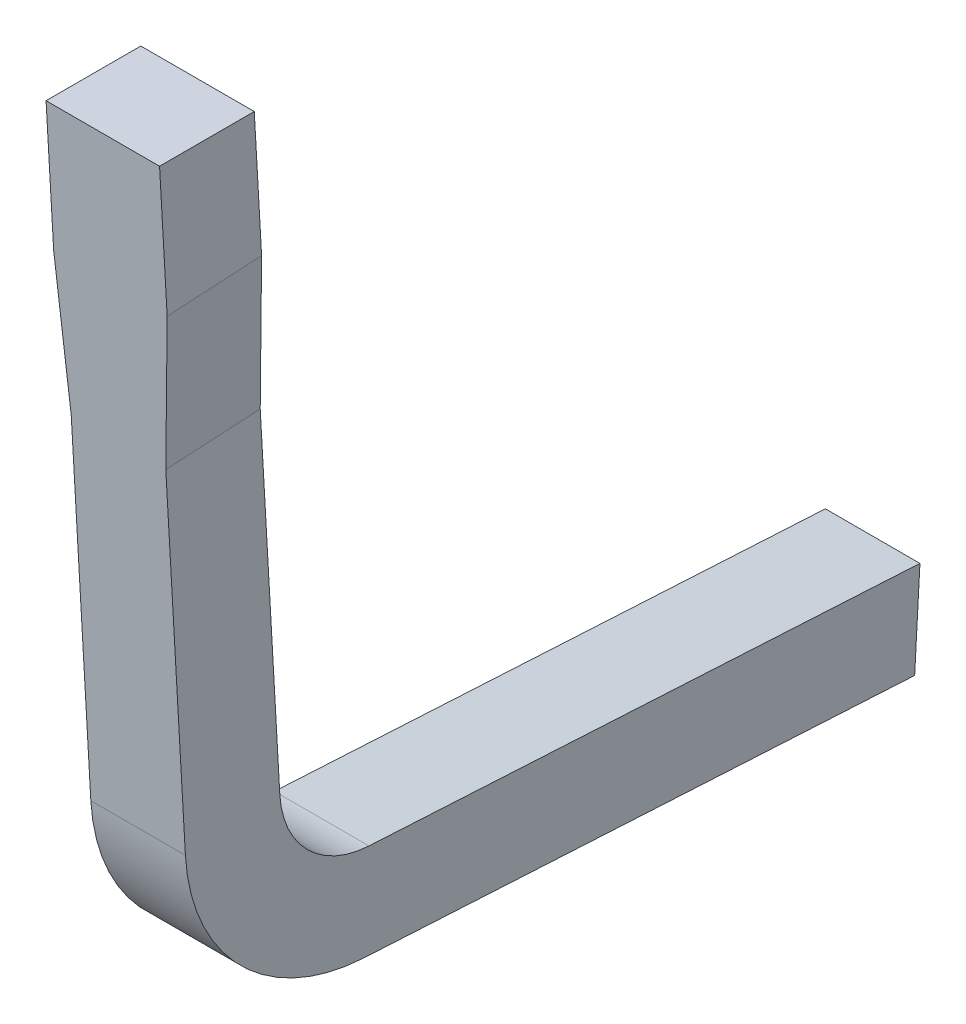
ISO-10303-21;
HEADER;
FILE_DESCRIPTION(('STEP AP214'),'2;1');
FILE_NAME('part.step','',(''),(''),'','','');
FILE_SCHEMA(('AUTOMOTIVE_DESIGN { 1 0 10303 214 1 1 1 1 }'));
ENDSEC;
DATA;
#1=APPLICATION_CONTEXT('core data for automotive mechanical design processes');
#2=APPLICATION_PROTOCOL_DEFINITION('international standard','automotive_design',2000,#1);
#3=PRODUCT_CONTEXT('',#1,'mechanical');
#4=PRODUCT('Part','Part','',(#3));
#5=PRODUCT_RELATED_PRODUCT_CATEGORY('part','',(#4));
#6=PRODUCT_DEFINITION_FORMATION('','',#4);
#7=PRODUCT_DEFINITION_CONTEXT('part definition',#1,'design');
#8=PRODUCT_DEFINITION('design','',#6,#7);
#9=PRODUCT_DEFINITION_SHAPE('','',#8);
#10=(LENGTH_UNIT() NAMED_UNIT(*) SI_UNIT(.MILLI.,.METRE.));
#11=(NAMED_UNIT(*) PLANE_ANGLE_UNIT() SI_UNIT($,.RADIAN.));
#12=(NAMED_UNIT(*) SI_UNIT($,.STERADIAN.) SOLID_ANGLE_UNIT());
#13=UNCERTAINTY_MEASURE_WITH_UNIT(LENGTH_MEASURE(1.E-05),#10,'distance_accuracy_value','');
#14=(GEOMETRIC_REPRESENTATION_CONTEXT(3) GLOBAL_UNCERTAINTY_ASSIGNED_CONTEXT((#13)) GLOBAL_UNIT_ASSIGNED_CONTEXT((#10,
#11,#12)) REPRESENTATION_CONTEXT('',''));
#15=CARTESIAN_POINT('',(0.,0.,0.));
#16=DIRECTION('',(0.,0.,1.));
#17=DIRECTION('',(1.,0.,0.));
#18=AXIS2_PLACEMENT_3D('',#15,#16,#17);
#19=CARTESIAN_POINT('',(-1.12,-1.879082198882,-10.32387202233));
#20=DIRECTION('',(1.,0.,0.));
#21=DIRECTION('',(0.,0.,-1.));
#22=AXIS2_PLACEMENT_3D('',#19,#20,#21);
#23=PLANE('',#22);
#24=DIRECTION('',(1.7997756063594E-13,-0.0569406083160486,0.998377567418559));
#25=VECTOR('',#24,1.);
#26=CARTESIAN_POINT('',(-1.12,-2.014836222708,-10.43177700759));
#27=LINE('',#26,#25);
#28=CARTESIAN_POINT('',(-1.12,-2.01483622270796,-10.4317770075908));
#29=VERTEX_POINT('',#28);
#30=CARTESIAN_POINT('',(-1.11999999999999,-2.02622434437119,-10.2321014941066));
#31=VERTEX_POINT('',#30);
#32=EDGE_CURVE('E183',#29,#31,#27,.T.);
#33=ORIENTED_EDGE('',*,*,#32,.T.);
#34=DIRECTION('',(0.,-0.998377567418999,-0.0569406083083299));
#35=VECTOR('',#34,1.);
#36=CARTESIAN_POINT('',(-1.12,-2.398052209196,-10.25330800505));
#37=LINE('',#36,#35);
#38=CARTESIAN_POINT('',(-1.12,-1.74332817505504,-10.2159670370689));
#39=VERTEX_POINT('',#38);
#40=EDGE_CURVE('E180',#39,#31,#37,.T.);
#41=ORIENTED_EDGE('',*,*,#40,.F.);
#42=DIRECTION('',(0.,0.,1.));
#43=VECTOR('',#42,1.);
#44=CARTESIAN_POINT('',(-1.12,-1.743328175055,-10.31612954398));
#45=LINE('',#44,#43);
#46=CARTESIAN_POINT('',(-1.12,-1.74332817505473,-10.4162920508947));
#47=VERTEX_POINT('',#46);
#48=EDGE_CURVE('E175',#47,#39,#45,.T.);
#49=ORIENTED_EDGE('',*,*,#48,.F.);
#50=DIRECTION('',(0.,-0.998377567418624,-0.0569406083148914));
#51=VECTOR('',#50,1.);
#52=CARTESIAN_POINT('',(-1.12,-2.392358148368,-10.45330826871));
#53=LINE('',#52,#51);
#54=EDGE_CURVE('E205',#47,#29,#53,.T.);
#55=ORIENTED_EDGE('',*,*,#54,.T.);
#56=EDGE_LOOP('',(#33,#41,#49,#55));
#57=FACE_BOUND('',#56,.T.);
#58=ADVANCED_FACE('F17',(#57),#23,.F.);
#59=CARTESIAN_POINT('',(-1.11,-2.170286918652,-10.3404803421));
#60=DIRECTION('',(0.997785157856611,0.0664110879137907,0.00378763292362404));
#61=DIRECTION('',(-0.0664115642910679,0.99779231512796,0.));
#62=AXIS2_PLACEMENT_3D('',#59,#60,#61);
#63=PLANE('',#62);
#64=DIRECTION('',(0.0665190105237393,-0.996166318707665,-0.0568144938493813));
#65=VECTOR('',#64,1.);
#66=CARTESIAN_POINT('',(-1.12,-2.02622434437119,-10.2321014941066));
#67=LINE('',#66,#65);
#68=CARTESIAN_POINT('',(-1.1,-2.32573761459706,-10.2491836765991));
#69=VERTEX_POINT('',#68);
#70=EDGE_CURVE('E161',#31,#69,#67,.T.);
#71=ORIENTED_EDGE('',*,*,#70,.F.);
#72=ORIENTED_EDGE('',*,*,#32,.F.);
#73=DIRECTION('',(0.0665190105237394,-0.996166318707292,-0.0568144938559241));
#74=VECTOR('',#73,1.);
#75=CARTESIAN_POINT('',(-1.12,-2.01483622270793,-10.4317770075911));
#76=LINE('',#75,#74);
#77=CARTESIAN_POINT('',(-1.1,-2.31434949293379,-10.4488591900838));
#78=VERTEX_POINT('',#77);
#79=EDGE_CURVE('E115',#29,#78,#76,.T.);
#80=ORIENTED_EDGE('',*,*,#79,.T.);
#81=DIRECTION('',(0.,-0.0569406083160594,0.998377567418558));
#82=VECTOR('',#81,1.);
#83=CARTESIAN_POINT('',(-1.1,-2.314349492934,-10.44885919008));
#84=LINE('',#83,#82);
#85=EDGE_CURVE('E110',#78,#69,#84,.T.);
#86=ORIENTED_EDGE('',*,*,#85,.T.);
#87=EDGE_LOOP('',(#71,#72,#80,#86));
#88=FACE_BOUND('',#87,.T.);
#89=ADVANCED_FACE('F288',(#88),#63,.F.);
#90=CARTESIAN_POINT('',(-0.88,-1.879082198882,-10.32387202233));
#91=DIRECTION('',(1.,0.,0.));
#92=DIRECTION('',(0.,0.,-1.));
#93=AXIS2_PLACEMENT_3D('',#90,#91,#92);
#94=PLANE('',#93);
#95=DIRECTION('',(0.,-0.998377567418624,-0.0569406083148914));
#96=VECTOR('',#95,1.);
#97=CARTESIAN_POINT('',(-0.88,-2.392358148368,-10.45330826871));
#98=LINE('',#97,#96);
#99=CARTESIAN_POINT('',(-0.880000000000078,-2.01483622270897,-10.4317770075904));
#100=VERTEX_POINT('',#99);
#101=CARTESIAN_POINT('',(-0.88,-1.74332817505473,-10.4162920508947));
#102=VERTEX_POINT('',#101);
#103=EDGE_CURVE('E128',#100,#102,#98,.F.);
#104=ORIENTED_EDGE('',*,*,#103,.T.);
#105=DIRECTION('',(0.,0.,1.));
#106=VECTOR('',#105,1.);
#107=CARTESIAN_POINT('',(-0.88,-1.743328175055,-10.31612954398));
#108=LINE('',#107,#106);
#109=CARTESIAN_POINT('',(-0.88,-1.74332817505504,-10.2159670370692));
#110=VERTEX_POINT('',#109);
#111=EDGE_CURVE('E185',#110,#102,#108,.F.);
#112=ORIENTED_EDGE('',*,*,#111,.F.);
#113=DIRECTION('',(0.,-0.998377567418999,-0.0569406083083299));
#114=VECTOR('',#113,1.);
#115=CARTESIAN_POINT('',(-0.88,-2.398052209196,-10.25330800505));
#116=LINE('',#115,#114);
#117=CARTESIAN_POINT('',(-0.88000000000004,-2.02622434437119,-10.2321014941066));
#118=VERTEX_POINT('',#117);
#119=EDGE_CURVE('E168',#118,#110,#116,.F.);
#120=ORIENTED_EDGE('',*,*,#119,.F.);
#121=DIRECTION('',(0.,-0.0569406083110753,0.998377567418842));
#122=VECTOR('',#121,1.);
#123=CARTESIAN_POINT('',(-0.880000000000117,-2.01483622270899,-10.43177700759));
#124=LINE('',#123,#122);
#125=EDGE_CURVE('E131',#100,#118,#124,.T.);
#126=ORIENTED_EDGE('',*,*,#125,.F.);
#127=EDGE_LOOP('',(#104,#112,#120,#126));
#128=FACE_BOUND('',#127,.T.);
#129=ADVANCED_FACE('F251',(#128),#94,.T.);
#130=CARTESIAN_POINT('',(-1.,-1.743328175055,-10.31612954398));
#131=DIRECTION('',(0.,1.,0.));
#132=DIRECTION('',(0.,0.,1.));
#133=AXIS2_PLACEMENT_3D('',#130,#131,#132);
#134=PLANE('',#133);
#135=DIRECTION('',(1.,0.,0.));
#136=VECTOR('',#135,1.);
#137=CARTESIAN_POINT('',(-1.,-1.74332817505459,-10.4162920508971));
#138=LINE('',#137,#136);
#139=EDGE_CURVE('E138',#102,#47,#138,.F.);
#140=ORIENTED_EDGE('',*,*,#139,.T.);
#141=ORIENTED_EDGE('',*,*,#48,.T.);
#142=DIRECTION('',(1.,0.,0.));
#143=VECTOR('',#142,1.);
#144=CARTESIAN_POINT('',(-1.,-1.74332817505506,-10.2159670370689));
#145=LINE('',#144,#143);
#146=EDGE_CURVE('E171',#110,#39,#145,.F.);
#147=ORIENTED_EDGE('',*,*,#146,.F.);
#148=ORIENTED_EDGE('',*,*,#111,.T.);
#149=EDGE_LOOP('',(#140,#141,#147,#148));
#150=FACE_BOUND('',#149,.T.);
#151=ADVANCED_FACE('F291',(#150),#134,.T.);
#152=CARTESIAN_POINT('',(-1.1,-2.898875732105,-11.04167004462));
#153=DIRECTION('',(1.,0.,0.));
#154=DIRECTION('',(0.,0.,-1.));
#155=AXIS2_PLACEMENT_3D('',#152,#153,#154);
#156=PLANE('',#155);
#157=CARTESIAN_POINT('',(-1.1,-3.03,-10.69));
#158=DIRECTION('',(-1.,0.,0.));
#159=DIRECTION('',(0.,0.,1.));
#160=AXIS2_PLACEMENT_3D('',#157,#158,#159);
#161=CIRCLE('',#160,0.4);
#162=CARTESIAN_POINT('',(-1.1,-3.05277624332116,-10.2906489730313));
#163=VERTEX_POINT('',#162);
#164=CARTESIAN_POINT('',(-1.1,-3.42937693582933,-10.6676826720305));
#165=VERTEX_POINT('',#164);
#166=EDGE_CURVE('E155',#163,#165,#161,.F.);
#167=ORIENTED_EDGE('',*,*,#166,.F.);
#168=DIRECTION('',(0.,-0.998377567418999,-0.0569406083083299));
#169=VECTOR('',#168,1.);
#170=CARTESIAN_POINT('',(-1.1,-2.398052209196,-10.25330800505));
#171=LINE('',#170,#169);
#172=EDGE_CURVE('E158',#69,#163,#171,.T.);
#173=ORIENTED_EDGE('',*,*,#172,.F.);
#174=ORIENTED_EDGE('',*,*,#85,.F.);
#175=DIRECTION('',(0.,-0.998377567418624,-0.0569406083148914));
#176=VECTOR('',#175,1.);
#177=CARTESIAN_POINT('',(-1.1,-2.392358148368,-10.45330826871));
#178=LINE('',#177,#176);
#179=CARTESIAN_POINT('',(-1.1,-3.0413881216286,-10.4903244865199));
#180=VERTEX_POINT('',#179);
#181=EDGE_CURVE('E104',#78,#180,#178,.T.);
#182=ORIENTED_EDGE('',*,*,#181,.T.);
#183=CARTESIAN_POINT('',(-1.1,-3.03,-10.69));
#184=DIRECTION('',(-1.,0.,0.));
#185=DIRECTION('',(0.,0.,1.));
#186=AXIS2_PLACEMENT_3D('',#183,#184,#185);
#187=CIRCLE('',#186,0.2);
#188=CARTESIAN_POINT('',(-1.1,-3.22968846791482,-10.6788413360177));
#189=VERTEX_POINT('',#188);
#190=EDGE_CURVE('E20',#180,#189,#187,.F.);
#191=ORIENTED_EDGE('',*,*,#190,.T.);
#192=DIRECTION('',(0.,0.0557933199228295,0.998442339572991));
#193=VECTOR('',#192,1.);
#194=CARTESIAN_POINT('',(-1.1,-3.262244863925,-11.26145022621));
#195=LINE('',#194,#193);
#196=CARTESIAN_POINT('',(-1.1,-3.29480125993501,-11.8440591164004));
#197=VERTEX_POINT('',#196);
#198=EDGE_CURVE('E123',#197,#189,#195,.T.);
#199=ORIENTED_EDGE('',*,*,#198,.F.);
#200=DIRECTION('',(0.,-0.998442339574031,0.0557933199042218));
#201=VECTOR('',#200,1.);
#202=CARTESIAN_POINT('',(-1.1,-3.394645493892,-11.83847978441));
#203=LINE('',#202,#201);
#204=CARTESIAN_POINT('',(-1.1,-3.49448972784906,-11.8329004524196));
#205=VERTEX_POINT('',#204);
#206=EDGE_CURVE('E148',#197,#205,#203,.T.);
#207=ORIENTED_EDGE('',*,*,#206,.T.);
#208=DIRECTION('',(0.,0.055793319922371,0.998442339573017));
#209=VECTOR('',#208,1.);
#210=CARTESIAN_POINT('',(-1.1,-3.461933331839,-11.25029156222));
#211=LINE('',#210,#209);
#212=EDGE_CURVE('E153',#205,#165,#211,.T.);
#213=ORIENTED_EDGE('',*,*,#212,.T.);
#214=EDGE_LOOP('',(#167,#173,#174,#182,#191,#199,#207,#213));
#215=FACE_BOUND('',#214,.T.);
#216=ADVANCED_FACE('F107',(#215),#156,.F.);
#217=CARTESIAN_POINT('',(-1.,-3.262244863925,-11.26145022621));
#218=DIRECTION('',(0.,0.998442339572991,-0.0557933199228295));
#219=DIRECTION('',(0.,0.0557933199228295,0.998442339572991));
#220=AXIS2_PLACEMENT_3D('',#217,#218,#219);
#221=PLANE('',#220);
#222=DIRECTION('',(0.,0.055793319922887,0.998442339572988));
#223=VECTOR('',#222,1.);
#224=CARTESIAN_POINT('',(-0.9,-3.294801259935,-11.8440591164));
#225=LINE('',#224,#223);
#226=CARTESIAN_POINT('',(-0.9,-3.29480125993501,-11.8440591164001));
#227=VERTEX_POINT('',#226);
#228=CARTESIAN_POINT('',(-0.9,-3.2296884679148,-10.6788413360177));
#229=VERTEX_POINT('',#228);
#230=EDGE_CURVE('E142',#227,#229,#225,.T.);
#231=ORIENTED_EDGE('',*,*,#230,.F.);
#232=DIRECTION('',(1.,0.,0.));
#233=VECTOR('',#232,1.);
#234=CARTESIAN_POINT('',(-1.,-3.29480125993502,-11.8440591164004));
#235=LINE('',#234,#233);
#236=EDGE_CURVE('E139',#227,#197,#235,.F.);
#237=ORIENTED_EDGE('',*,*,#236,.T.);
#238=ORIENTED_EDGE('',*,*,#198,.T.);
#239=DIRECTION('',(-1.,0.,0.));
#240=VECTOR('',#239,1.);
#241=CARTESIAN_POINT('',(-0.896,-3.22968846791485,-10.67884133602));
#242=LINE('',#241,#240);
#243=EDGE_CURVE('E122',#189,#229,#242,.F.);
#244=ORIENTED_EDGE('',*,*,#243,.T.);
#245=EDGE_LOOP('',(#231,#237,#238,#244));
#246=FACE_BOUND('',#245,.T.);
#247=ADVANCED_FACE('F284',(#246),#221,.T.);
#248=CARTESIAN_POINT('',(-0.896,-3.03,-10.69));
#249=DIRECTION('',(-1.,0.,0.));
#250=DIRECTION('',(0.,0.,1.));
#251=AXIS2_PLACEMENT_3D('',#248,#249,#250);
#252=CYLINDRICAL_SURFACE('',#251,0.2);
#253=ORIENTED_EDGE('',*,*,#190,.F.);
#254=DIRECTION('',(1.,0.,0.));
#255=VECTOR('',#254,1.);
#256=CARTESIAN_POINT('',(-1.,-3.04138812159455,-10.4903244865179));
#257=LINE('',#256,#255);
#258=CARTESIAN_POINT('',(-0.9,-3.04138812162905,-10.4903244865184));
#259=VERTEX_POINT('',#258);
#260=EDGE_CURVE('E114',#180,#259,#257,.T.);
#261=ORIENTED_EDGE('',*,*,#260,.T.);
#262=CARTESIAN_POINT('',(-0.9,-3.03,-10.69));
#263=DIRECTION('',(-1.,0.,0.));
#264=DIRECTION('',(0.,0.,1.));
#265=AXIS2_PLACEMENT_3D('',#262,#263,#264);
#266=CIRCLE('',#265,0.2);
#267=EDGE_CURVE('E223',#229,#259,#266,.T.);
#268=ORIENTED_EDGE('',*,*,#267,.F.);
#269=ORIENTED_EDGE('',*,*,#243,.F.);
#270=EDGE_LOOP('',(#253,#261,#268,#269));
#271=FACE_BOUND('',#270,.T.);
#272=ADVANCED_FACE('F119',(#271),#252,.F.);
#273=CARTESIAN_POINT('',(-1.,-2.392358148368,-10.45330826871));
#274=DIRECTION('',(0.,-0.0569406083148914,0.998377567418624));
#275=DIRECTION('',(0.,-0.998377567418624,-0.0569406083148914));
#276=AXIS2_PLACEMENT_3D('',#273,#274,#275);
#277=PLANE('',#276);
#278=DIRECTION('',(0.0665190105237401,0.99616631870813,0.0568144938412267));
#279=VECTOR('',#278,1.);
#280=CARTESIAN_POINT('',(-0.900000000000051,-2.314349492934,-10.44885919008));
#281=LINE('',#280,#279);
#282=CARTESIAN_POINT('',(-0.900000000000017,-2.314349492934,-10.44885919008));
#283=VERTEX_POINT('',#282);
#284=EDGE_CURVE('E165',#283,#100,#281,.T.);
#285=ORIENTED_EDGE('',*,*,#284,.F.);
#286=DIRECTION('',(0.,0.998377567418421,0.0569406083184697));
#287=VECTOR('',#286,1.);
#288=CARTESIAN_POINT('',(-0.9,-3.041388121684,-10.49032448652));
#289=LINE('',#288,#287);
#290=EDGE_CURVE('E126',#259,#283,#289,.T.);
#291=ORIENTED_EDGE('',*,*,#290,.F.);
#292=ORIENTED_EDGE('',*,*,#260,.F.);
#293=ORIENTED_EDGE('',*,*,#181,.F.);
#294=ORIENTED_EDGE('',*,*,#79,.F.);
#295=ORIENTED_EDGE('',*,*,#54,.F.);
#296=ORIENTED_EDGE('',*,*,#139,.F.);
#297=ORIENTED_EDGE('',*,*,#103,.F.);
#298=EDGE_LOOP('',(#285,#291,#292,#293,#294,#295,#296,#297));
#299=FACE_BOUND('',#298,.T.);
#300=ADVANCED_FACE('F124',(#299),#277,.F.);
#301=CARTESIAN_POINT('',(-0.8900000000001,-2.170286918653,-10.34048034209));
#302=DIRECTION('',(0.997785157856611,-0.0664110879138008,-0.00378763292346404));
#303=DIRECTION('',(0.0664115642910779,0.997792315127959,0.));
#304=AXIS2_PLACEMENT_3D('',#301,#302,#303);
#305=PLANE('',#304);
#306=DIRECTION('',(0.,-0.0569406083160594,0.998377567418558));
#307=VECTOR('',#306,1.);
#308=CARTESIAN_POINT('',(-0.9,-2.314349492934,-10.44885919008));
#309=LINE('',#308,#307);
#310=CARTESIAN_POINT('',(-0.9,-2.32573761459702,-10.2491836765997));
#311=VERTEX_POINT('',#310);
#312=EDGE_CURVE('E238',#283,#311,#309,.T.);
#313=ORIENTED_EDGE('',*,*,#312,.F.);
#314=ORIENTED_EDGE('',*,*,#284,.T.);
#315=ORIENTED_EDGE('',*,*,#125,.T.);
#316=DIRECTION('',(0.0665190105237393,0.996166318707665,0.0568144938493813));
#317=VECTOR('',#316,1.);
#318=CARTESIAN_POINT('',(-0.9,-2.32573761459705,-10.2491836765991));
#319=LINE('',#318,#317);
#320=EDGE_CURVE('E160',#311,#118,#319,.T.);
#321=ORIENTED_EDGE('',*,*,#320,.F.);
#322=EDGE_LOOP('',(#313,#314,#315,#321));
#323=FACE_BOUND('',#322,.T.);
#324=ADVANCED_FACE('F245',(#323),#305,.T.);
#325=CARTESIAN_POINT('',(-1.,-2.398052209196,-10.25330800505));
#326=DIRECTION('',(0.,-0.0569406083083299,0.998377567418999));
#327=DIRECTION('',(0.,-0.998377567418999,-0.0569406083083299));
#328=AXIS2_PLACEMENT_3D('',#325,#326,#327);
#329=PLANE('',#328);
#330=ORIENTED_EDGE('',*,*,#119,.T.);
#331=ORIENTED_EDGE('',*,*,#146,.T.);
#332=ORIENTED_EDGE('',*,*,#40,.T.);
#333=ORIENTED_EDGE('',*,*,#70,.T.);
#334=ORIENTED_EDGE('',*,*,#172,.T.);
#335=DIRECTION('',(-1.,0.,0.));
#336=VECTOR('',#335,1.);
#337=CARTESIAN_POINT('',(-0.896,-3.05277624331888,-10.2906489730321));
#338=LINE('',#337,#336);
#339=CARTESIAN_POINT('',(-0.9,-3.05277624332089,-10.2906489730312));
#340=VERTEX_POINT('',#339);
#341=EDGE_CURVE('E198',#340,#163,#338,.T.);
#342=ORIENTED_EDGE('',*,*,#341,.F.);
#343=DIRECTION('',(0.,-0.998377567419076,-0.0569406083069694));
#344=VECTOR('',#343,1.);
#345=CARTESIAN_POINT('',(-0.9,-2.325737614597,-10.2491836766));
#346=LINE('',#345,#344);
#347=EDGE_CURVE('E222',#311,#340,#346,.T.);
#348=ORIENTED_EDGE('',*,*,#347,.F.);
#349=ORIENTED_EDGE('',*,*,#320,.T.);
#350=EDGE_LOOP('',(#330,#331,#332,#333,#334,#342,#348,#349));
#351=FACE_BOUND('',#350,.T.);
#352=ADVANCED_FACE('F255',(#351),#329,.T.);
#353=CARTESIAN_POINT('',(-0.896,-3.03,-10.69));
#354=DIRECTION('',(-1.,0.,0.));
#355=DIRECTION('',(0.,0.,1.));
#356=AXIS2_PLACEMENT_3D('',#353,#354,#355);
#357=CYLINDRICAL_SURFACE('',#356,0.4);
#358=DIRECTION('',(1.,0.,0.));
#359=VECTOR('',#358,1.);
#360=CARTESIAN_POINT('',(-1.,-3.4293769358293,-10.66768267203));
#361=LINE('',#360,#359);
#362=CARTESIAN_POINT('',(-0.9,-3.42937693582946,-10.6676826720306));
#363=VERTEX_POINT('',#362);
#364=EDGE_CURVE('E150',#165,#363,#361,.T.);
#365=ORIENTED_EDGE('',*,*,#364,.T.);
#366=CARTESIAN_POINT('',(-0.9,-3.03,-10.69));
#367=DIRECTION('',(-1.,0.,0.));
#368=DIRECTION('',(0.,0.,1.));
#369=AXIS2_PLACEMENT_3D('',#366,#367,#368);
#370=CIRCLE('',#369,0.4);
#371=EDGE_CURVE('E219',#340,#363,#370,.F.);
#372=ORIENTED_EDGE('',*,*,#371,.F.);
#373=ORIENTED_EDGE('',*,*,#341,.T.);
#374=ORIENTED_EDGE('',*,*,#166,.T.);
#375=EDGE_LOOP('',(#365,#372,#373,#374));
#376=FACE_BOUND('',#375,.T.);
#377=ADVANCED_FACE('F273',(#376),#357,.T.);
#378=CARTESIAN_POINT('',(-1.,-3.461933331839,-11.25029156222));
#379=DIRECTION('',(0.,0.998442339573017,-0.055793319922371));
#380=DIRECTION('',(0.,0.055793319922371,0.998442339573017));
#381=AXIS2_PLACEMENT_3D('',#378,#379,#380);
#382=PLANE('',#381);
#383=ORIENTED_EDGE('',*,*,#364,.F.);
#384=ORIENTED_EDGE('',*,*,#212,.F.);
#385=DIRECTION('',(1.,0.,0.));
#386=VECTOR('',#385,1.);
#387=CARTESIAN_POINT('',(-1.,-3.49448972784898,-11.8329004524196));
#388=LINE('',#387,#386);
#389=CARTESIAN_POINT('',(-0.9,-3.49448972784899,-11.8329004524199));
#390=VERTEX_POINT('',#389);
#391=EDGE_CURVE('E35',#205,#390,#388,.T.);
#392=ORIENTED_EDGE('',*,*,#391,.T.);
#393=DIRECTION('',(0.,-0.0557933199219327,-0.998442339573042));
#394=VECTOR('',#393,1.);
#395=CARTESIAN_POINT('',(-0.9,-3.429376935829,-10.66768267202));
#396=LINE('',#395,#394);
#397=EDGE_CURVE('E26',#363,#390,#396,.T.);
#398=ORIENTED_EDGE('',*,*,#397,.F.);
#399=EDGE_LOOP('',(#383,#384,#392,#398));
#400=FACE_BOUND('',#399,.T.);
#401=ADVANCED_FACE('F274',(#400),#382,.F.);
#402=CARTESIAN_POINT('',(-1.,-3.394645493892,-11.83847978441));
#403=DIRECTION('',(0.,0.0557933199042218,0.998442339574031));
#404=DIRECTION('',(0.,-0.998442339574031,0.0557933199042218));
#405=AXIS2_PLACEMENT_3D('',#402,#403,#404);
#406=PLANE('',#405);
#407=DIRECTION('',(0.,0.998442339574254,-0.0557933199002383));
#408=VECTOR('',#407,1.);
#409=CARTESIAN_POINT('',(-0.9,-3.494489727849,-11.83290045242));
#410=LINE('',#409,#408);
#411=EDGE_CURVE('E11',#390,#227,#410,.T.);
#412=ORIENTED_EDGE('',*,*,#411,.F.);
#413=ORIENTED_EDGE('',*,*,#391,.F.);
#414=ORIENTED_EDGE('',*,*,#206,.F.);
#415=ORIENTED_EDGE('',*,*,#236,.F.);
#416=EDGE_LOOP('',(#412,#413,#414,#415));
#417=FACE_BOUND('',#416,.T.);
#418=ADVANCED_FACE('F281',(#417),#406,.F.);
#419=CARTESIAN_POINT('',(-0.9,-2.909472777839,-11.05227927458));
#420=DIRECTION('',(1.,0.,0.));
#421=DIRECTION('',(0.,0.,-1.));
#422=AXIS2_PLACEMENT_3D('',#419,#420,#421);
#423=PLANE('',#422);
#424=ORIENTED_EDGE('',*,*,#397,.T.);
#425=ORIENTED_EDGE('',*,*,#411,.T.);
#426=ORIENTED_EDGE('',*,*,#230,.T.);
#427=ORIENTED_EDGE('',*,*,#267,.T.);
#428=ORIENTED_EDGE('',*,*,#290,.T.);
#429=ORIENTED_EDGE('',*,*,#312,.T.);
#430=ORIENTED_EDGE('',*,*,#347,.T.);
#431=ORIENTED_EDGE('',*,*,#371,.T.);
#432=EDGE_LOOP('',(#424,#425,#426,#427,#428,#429,#430,#431));
#433=FACE_BOUND('',#432,.T.);
#434=ADVANCED_FACE('F260',(#433),#423,.T.);
#435=CLOSED_SHELL('',(#58,#89,#129,#151,#216,#247,#272,#300,#324,#352,#377,#401,#418,#434));
#436=MANIFOLD_SOLID_BREP('B1',#435);
#437=ADVANCED_BREP_SHAPE_REPRESENTATION('',(#18,#436),#14);
#438=SHAPE_DEFINITION_REPRESENTATION(#9,#437);
ENDSEC;
END-ISO-10303-21;
